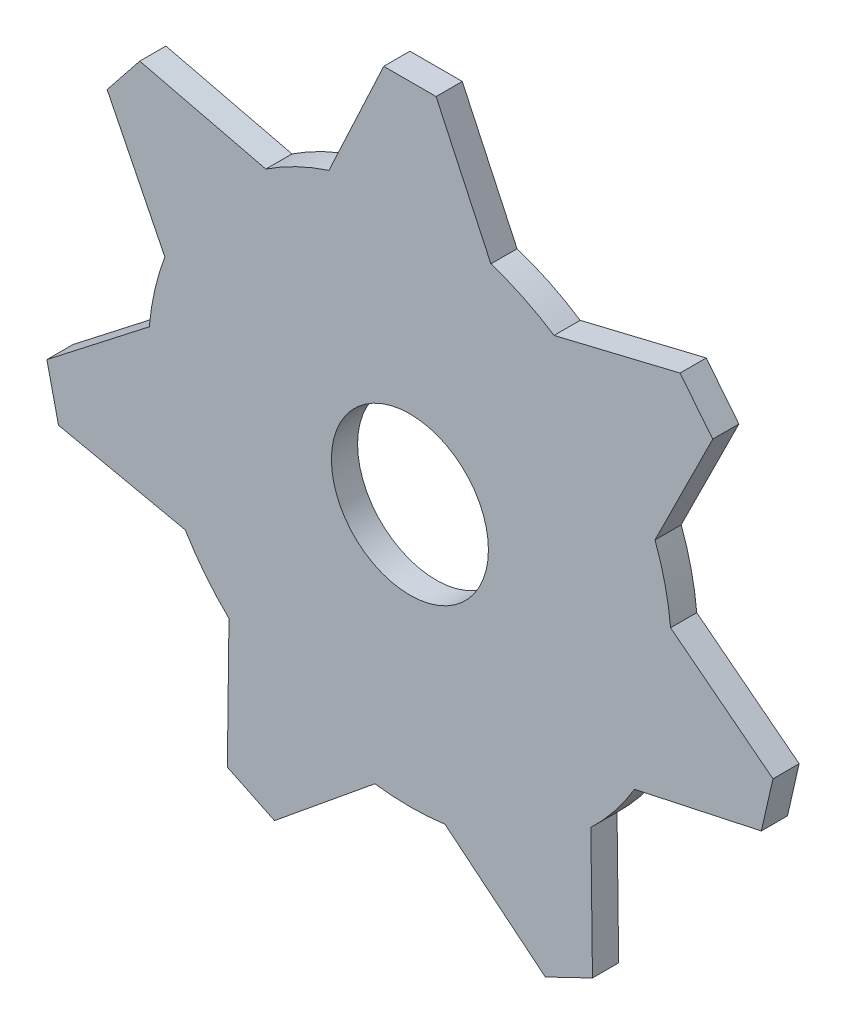
ISO-10303-21;
HEADER;
FILE_DESCRIPTION(('STEP AP214'),'2;1');
FILE_NAME('part.step','',(''),(''),'','','');
FILE_SCHEMA(('AUTOMOTIVE_DESIGN { 1 0 10303 214 1 1 1 1 }'));
ENDSEC;
DATA;
#1=APPLICATION_CONTEXT('core data for automotive mechanical design processes');
#2=APPLICATION_PROTOCOL_DEFINITION('international standard','automotive_design',2000,#1);
#3=PRODUCT_CONTEXT('',#1,'mechanical');
#4=PRODUCT('Part','Part','',(#3));
#5=PRODUCT_RELATED_PRODUCT_CATEGORY('part','',(#4));
#6=PRODUCT_DEFINITION_FORMATION('','',#4);
#7=PRODUCT_DEFINITION_CONTEXT('part definition',#1,'design');
#8=PRODUCT_DEFINITION('design','',#6,#7);
#9=PRODUCT_DEFINITION_SHAPE('','',#8);
#10=(LENGTH_UNIT() NAMED_UNIT(*) SI_UNIT(.MILLI.,.METRE.));
#11=(NAMED_UNIT(*) PLANE_ANGLE_UNIT() SI_UNIT($,.RADIAN.));
#12=(NAMED_UNIT(*) SI_UNIT($,.STERADIAN.) SOLID_ANGLE_UNIT());
#13=UNCERTAINTY_MEASURE_WITH_UNIT(LENGTH_MEASURE(1.E-05),#10,'distance_accuracy_value','');
#14=(GEOMETRIC_REPRESENTATION_CONTEXT(3) GLOBAL_UNCERTAINTY_ASSIGNED_CONTEXT((#13)) GLOBAL_UNIT_ASSIGNED_CONTEXT((#10,
#11,#12)) REPRESENTATION_CONTEXT('',''));
#15=CARTESIAN_POINT('',(0.,0.,0.));
#16=DIRECTION('',(0.,0.,1.));
#17=DIRECTION('',(1.,0.,0.));
#18=AXIS2_PLACEMENT_3D('',#15,#16,#17);
#19=CARTESIAN_POINT('',(0.,0.,1.27));
#20=DIRECTION('',(0.,0.,-1.));
#21=DIRECTION('',(-1.,0.,0.));
#22=AXIS2_PLACEMENT_3D('',#19,#20,#21);
#23=CYLINDRICAL_SURFACE('',#22,12.7);
#24=CARTESIAN_POINT('',(0.,0.,0.));
#25=DIRECTION('',(0.,0.,1.));
#26=DIRECTION('',(1.,0.,0.));
#27=AXIS2_PLACEMENT_3D('',#24,#25,#26);
#28=CIRCLE('',#27,12.7);
#29=CARTESIAN_POINT('',(6.99207173977358,10.6019306159708,0.));
#30=VERTEX_POINT('',#29);
#31=CARTESIAN_POINT('',(3.92943770689404,12.0768174329017,0.));
#32=VERTEX_POINT('',#31);
#33=EDGE_CURVE('E266',#30,#32,#28,.T.);
#34=ORIENTED_EDGE('',*,*,#33,.T.);
#35=DIRECTION('',(0.,0.,1.));
#36=VECTOR('',#35,1.);
#37=CARTESIAN_POINT('',(3.92943770689404,12.0768174329017,0.));
#38=LINE('',#37,#36);
#39=CARTESIAN_POINT('',(3.92943770689404,12.0768174329017,1.27));
#40=VERTEX_POINT('',#39);
#41=EDGE_CURVE('E256',#32,#40,#38,.T.);
#42=ORIENTED_EDGE('',*,*,#41,.T.);
#43=CARTESIAN_POINT('',(0.,0.,1.27));
#44=DIRECTION('',(0.,0.,1.));
#45=DIRECTION('',(1.,0.,0.));
#46=AXIS2_PLACEMENT_3D('',#43,#44,#45);
#47=CIRCLE('',#46,12.7);
#48=CARTESIAN_POINT('',(6.99207173977358,10.6019306159708,1.27));
#49=VERTEX_POINT('',#48);
#50=EDGE_CURVE('E263',#49,#40,#47,.T.);
#51=ORIENTED_EDGE('',*,*,#50,.F.);
#52=DIRECTION('',(0.,0.,1.));
#53=VECTOR('',#52,1.);
#54=CARTESIAN_POINT('',(6.99207173977358,10.6019306159708,0.));
#55=LINE('',#54,#53);
#56=EDGE_CURVE('E428',#30,#49,#55,.T.);
#57=ORIENTED_EDGE('',*,*,#56,.F.);
#58=EDGE_LOOP('',(#34,#42,#51,#57));
#59=FACE_BOUND('',#58,.T.);
#60=ADVANCED_FACE('F32',(#59),#23,.T.);
#61=CARTESIAN_POINT('',(11.8920004143489,4.45761440067741,0.));
#62=DIRECTION('',(0.895489924657309,-0.445081784436577,0.));
#63=DIRECTION('',(0.445081784436577,0.895489924657309,0.));
#64=AXIS2_PLACEMENT_3D('',#61,#62,#63);
#65=PLANE('',#64);
#66=DIRECTION('',(0.445081784436577,0.895489924657309,0.));
#67=VECTOR('',#66,1.);
#68=CARTESIAN_POINT('',(11.8920004143489,4.45761440067741,1.27));
#69=LINE('',#68,#67);
#70=CARTESIAN_POINT('',(11.8920004143489,4.45761440067741,1.27));
#71=VERTEX_POINT('',#70);
#72=CARTESIAN_POINT('',(14.692795806642,10.0927226943141,1.27));
#73=VERTEX_POINT('',#72);
#74=EDGE_CURVE('E431',#71,#73,#69,.T.);
#75=ORIENTED_EDGE('',*,*,#74,.F.);
#76=DIRECTION('',(0.,0.,1.));
#77=VECTOR('',#76,1.);
#78=CARTESIAN_POINT('',(11.8920004143489,4.45761440067741,0.));
#79=LINE('',#78,#77);
#80=CARTESIAN_POINT('',(11.8920004143489,4.45761440067741,0.));
#81=VERTEX_POINT('',#80);
#82=EDGE_CURVE('E40',#81,#71,#79,.T.);
#83=ORIENTED_EDGE('',*,*,#82,.F.);
#84=DIRECTION('',(0.445081784436577,0.895489924657309,0.));
#85=VECTOR('',#84,1.);
#86=CARTESIAN_POINT('',(11.8920004143489,4.45761440067741,0.));
#87=LINE('',#86,#85);
#88=CARTESIAN_POINT('',(14.692795806642,10.0927226943141,0.));
#89=VERTEX_POINT('',#88);
#90=EDGE_CURVE('E11',#81,#89,#87,.T.);
#91=ORIENTED_EDGE('',*,*,#90,.T.);
#92=DIRECTION('',(0.,0.,1.));
#93=VECTOR('',#92,1.);
#94=CARTESIAN_POINT('',(14.692795806642,10.0927226943141,0.));
#95=LINE('',#94,#93);
#96=EDGE_CURVE('E414',#89,#73,#95,.T.);
#97=ORIENTED_EDGE('',*,*,#96,.T.);
#98=EDGE_LOOP('',(#75,#83,#91,#97));
#99=FACE_BOUND('',#98,.T.);
#100=ADVANCED_FACE('F34',(#99),#65,.T.);
#101=CARTESIAN_POINT('',(13.1091317099208,12.0785746597828,0.));
#102=DIRECTION('',(-0.234657400467723,0.972078136985773,0.));
#103=DIRECTION('',(-0.972078136985773,-0.234657400467723,0.));
#104=AXIS2_PLACEMENT_3D('',#101,#102,#103);
#105=PLANE('',#104);
#106=DIRECTION('',(-0.972078136985773,-0.234657400467723,0.));
#107=VECTOR('',#106,1.);
#108=CARTESIAN_POINT('',(13.1091317099208,12.0785746597828,1.27));
#109=LINE('',#108,#107);
#110=CARTESIAN_POINT('',(13.1091317099208,12.0785746597828,1.27));
#111=VERTEX_POINT('',#110);
#112=EDGE_CURVE('E422',#111,#49,#109,.T.);
#113=ORIENTED_EDGE('',*,*,#112,.F.);
#114=DIRECTION('',(0.,0.,1.));
#115=VECTOR('',#114,1.);
#116=CARTESIAN_POINT('',(13.1091317099208,12.0785746597828,0.));
#117=LINE('',#116,#115);
#118=CARTESIAN_POINT('',(13.1091317099208,12.0785746597828,0.));
#119=VERTEX_POINT('',#118);
#120=EDGE_CURVE('E419',#119,#111,#117,.T.);
#121=ORIENTED_EDGE('',*,*,#120,.F.);
#122=DIRECTION('',(-0.972078136985773,-0.234657400467723,0.));
#123=VECTOR('',#122,1.);
#124=CARTESIAN_POINT('',(13.1091317099208,12.0785746597828,0.));
#125=LINE('',#124,#123);
#126=EDGE_CURVE('E425',#119,#30,#125,.T.);
#127=ORIENTED_EDGE('',*,*,#126,.T.);
#128=ORIENTED_EDGE('',*,*,#56,.T.);
#129=EDGE_LOOP('',(#113,#121,#127,#128));
#130=FACE_BOUND('',#129,.T.);
#131=ADVANCED_FACE('F443',(#130),#105,.T.);
#132=CARTESIAN_POINT('',(13.9009637582814,11.0856486770485,0.));
#133=DIRECTION('',(0.781831482468022,0.623489801858743,0.));
#134=DIRECTION('',(0.,0.,1.));
#135=AXIS2_PLACEMENT_3D('',#132,#133,#134);
#136=PLANE('',#135);
#137=DIRECTION('',(-0.623489801858743,0.781831482468022,0.));
#138=VECTOR('',#137,1.);
#139=CARTESIAN_POINT('',(13.9009637582814,11.0856486770485,1.27));
#140=LINE('',#139,#138);
#141=EDGE_CURVE('E412',#73,#111,#140,.T.);
#142=ORIENTED_EDGE('',*,*,#141,.F.);
#143=ORIENTED_EDGE('',*,*,#96,.F.);
#144=DIRECTION('',(-0.623489801858743,0.781831482468022,0.));
#145=VECTOR('',#144,1.);
#146=CARTESIAN_POINT('',(14.692795806642,10.0927226943141,0.));
#147=LINE('',#146,#145);
#148=EDGE_CURVE('E417',#89,#119,#147,.T.);
#149=ORIENTED_EDGE('',*,*,#148,.T.);
#150=ORIENTED_EDGE('',*,*,#120,.T.);
#151=EDGE_LOOP('',(#142,#143,#149,#150));
#152=FACE_BOUND('',#151,.T.);
#153=ADVANCED_FACE('F440',(#152),#136,.T.);
#154=CARTESIAN_POINT('',(12.6484085541212,1.14357380524166,0.));
#155=VERTEX_POINT('',#154);
#156=EDGE_CURVE('E47',#155,#81,#28,.T.);
#157=ORIENTED_EDGE('',*,*,#156,.T.);
#158=ORIENTED_EDGE('',*,*,#82,.T.);
#159=CARTESIAN_POINT('',(12.6484085541212,1.14357380524166,1.27));
#160=VERTEX_POINT('',#159);
#161=EDGE_CURVE('E55',#160,#71,#47,.T.);
#162=ORIENTED_EDGE('',*,*,#161,.F.);
#163=DIRECTION('',(0.,0.,1.));
#164=VECTOR('',#163,1.);
#165=CARTESIAN_POINT('',(12.6484085541212,1.14357380524166,0.));
#166=LINE('',#165,#164);
#167=EDGE_CURVE('E400',#155,#160,#166,.T.);
#168=ORIENTED_EDGE('',*,*,#167,.F.);
#169=EDGE_LOOP('',(#157,#158,#162,#168));
#170=FACE_BOUND('',#169,.T.);
#171=ADVANCED_FACE('F432',(#170),#23,.T.);
#172=CARTESIAN_POINT('',(10.8996442571988,-6.51826319401983,0.));
#173=DIRECTION('',(0.21034988434551,-0.977626168919302,0.));
#174=DIRECTION('',(0.977626168919302,0.21034988434551,0.));
#175=AXIS2_PLACEMENT_3D('',#172,#173,#174);
#176=PLANE('',#175);
#177=DIRECTION('',(0.977626168919302,0.21034988434551,0.));
#178=VECTOR('',#177,1.);
#179=CARTESIAN_POINT('',(10.8996442571988,-6.51826319401983,1.27));
#180=LINE('',#179,#178);
#181=CARTESIAN_POINT('',(10.8996442571988,-6.51826319401983,1.27));
#182=VERTEX_POINT('',#181);
#183=CARTESIAN_POINT('',(17.0516166924684,-5.19458065421402,1.27));
#184=VERTEX_POINT('',#183);
#185=EDGE_CURVE('E403',#182,#184,#180,.T.);
#186=ORIENTED_EDGE('',*,*,#185,.F.);
#187=DIRECTION('',(0.,0.,1.));
#188=VECTOR('',#187,1.);
#189=CARTESIAN_POINT('',(10.8996442571988,-6.51826319401983,0.));
#190=LINE('',#189,#188);
#191=CARTESIAN_POINT('',(10.8996442571988,-6.51826319401983,0.));
#192=VERTEX_POINT('',#191);
#193=EDGE_CURVE('E406',#192,#182,#190,.T.);
#194=ORIENTED_EDGE('',*,*,#193,.F.);
#195=DIRECTION('',(0.977626168919302,0.21034988434551,0.));
#196=VECTOR('',#195,1.);
#197=CARTESIAN_POINT('',(10.8996442571988,-6.51826319401983,0.));
#198=LINE('',#197,#196);
#199=CARTESIAN_POINT('',(17.0516166924684,-5.19458065421402,0.));
#200=VERTEX_POINT('',#199);
#201=EDGE_CURVE('E409',#192,#200,#198,.T.);
#202=ORIENTED_EDGE('',*,*,#201,.T.);
#203=DIRECTION('',(0.,0.,1.));
#204=VECTOR('',#203,1.);
#205=CARTESIAN_POINT('',(17.0516166924684,-5.19458065421402,0.));
#206=LINE('',#205,#204);
#207=EDGE_CURVE('E387',#200,#184,#206,.T.);
#208=ORIENTED_EDGE('',*,*,#207,.T.);
#209=EDGE_LOOP('',(#186,#194,#202,#208));
#210=FACE_BOUND('',#209,.T.);
#211=ADVANCED_FACE('F498',(#210),#176,.T.);
#212=CARTESIAN_POINT('',(17.6168198647174,-2.71826375727219,0.));
#213=DIRECTION('',(0.613694794792043,0.789543348300239,0.));
#214=DIRECTION('',(-0.789543348300239,0.613694794792043,0.));
#215=AXIS2_PLACEMENT_3D('',#212,#213,#214);
#216=PLANE('',#215);
#217=DIRECTION('',(-0.789543348300239,0.613694794792043,0.));
#218=VECTOR('',#217,1.);
#219=CARTESIAN_POINT('',(17.6168198647174,-2.71826375727219,1.27));
#220=LINE('',#219,#218);
#221=CARTESIAN_POINT('',(17.6168198647174,-2.71826375727219,1.27));
#222=VERTEX_POINT('',#221);
#223=EDGE_CURVE('E395',#222,#160,#220,.T.);
#224=ORIENTED_EDGE('',*,*,#223,.F.);
#225=DIRECTION('',(0.,0.,1.));
#226=VECTOR('',#225,1.);
#227=CARTESIAN_POINT('',(17.6168198647174,-2.71826375727219,0.));
#228=LINE('',#227,#226);
#229=CARTESIAN_POINT('',(17.6168198647174,-2.71826375727219,0.));
#230=VERTEX_POINT('',#229);
#231=EDGE_CURVE('E392',#230,#222,#228,.T.);
#232=ORIENTED_EDGE('',*,*,#231,.F.);
#233=DIRECTION('',(-0.789543348300239,0.613694794792043,0.));
#234=VECTOR('',#233,1.);
#235=CARTESIAN_POINT('',(17.6168198647174,-2.71826375727219,0.));
#236=LINE('',#235,#234);
#237=EDGE_CURVE('E397',#230,#155,#236,.T.);
#238=ORIENTED_EDGE('',*,*,#237,.T.);
#239=ORIENTED_EDGE('',*,*,#167,.T.);
#240=EDGE_LOOP('',(#224,#232,#238,#239));
#241=FACE_BOUND('',#240,.T.);
#242=ADVANCED_FACE('F504',(#241),#216,.T.);
#243=CARTESIAN_POINT('',(17.3342182785929,-3.9564222057431,0.));
#244=DIRECTION('',(0.974927912181826,-0.222520933956305,0.));
#245=DIRECTION('',(0.,0.,1.));
#246=AXIS2_PLACEMENT_3D('',#243,#244,#245);
#247=PLANE('',#246);
#248=DIRECTION('',(0.222520933956305,0.974927912181826,0.));
#249=VECTOR('',#248,1.);
#250=CARTESIAN_POINT('',(17.3342182785929,-3.9564222057431,1.27));
#251=LINE('',#250,#249);
#252=EDGE_CURVE('E385',#184,#222,#251,.T.);
#253=ORIENTED_EDGE('',*,*,#252,.F.);
#254=ORIENTED_EDGE('',*,*,#207,.F.);
#255=DIRECTION('',(0.222520933956305,0.974927912181826,0.));
#256=VECTOR('',#255,1.);
#257=CARTESIAN_POINT('',(17.0516166924684,-5.19458065421402,0.));
#258=LINE('',#257,#256);
#259=EDGE_CURVE('E390',#200,#230,#258,.T.);
#260=ORIENTED_EDGE('',*,*,#259,.T.);
#261=ORIENTED_EDGE('',*,*,#231,.T.);
#262=EDGE_LOOP('',(#253,#254,#260,#261));
#263=FACE_BOUND('',#262,.T.);
#264=ADVANCED_FACE('F510',(#263),#247,.T.);
#265=CARTESIAN_POINT('',(8.78023574670098,-9.1759174054889,0.));
#266=VERTEX_POINT('',#265);
#267=EDGE_CURVE('E355',#266,#192,#28,.T.);
#268=ORIENTED_EDGE('',*,*,#267,.T.);
#269=ORIENTED_EDGE('',*,*,#193,.T.);
#270=CARTESIAN_POINT('',(8.78023574670098,-9.1759174054889,1.27));
#271=VERTEX_POINT('',#270);
#272=EDGE_CURVE('E359',#271,#182,#47,.T.);
#273=ORIENTED_EDGE('',*,*,#272,.F.);
#274=DIRECTION('',(0.,0.,1.));
#275=VECTOR('',#274,1.);
#276=CARTESIAN_POINT('',(8.78023574670098,-9.1759174054889,0.));
#277=LINE('',#276,#275);
#278=EDGE_CURVE('E373',#266,#271,#277,.T.);
#279=ORIENTED_EDGE('',*,*,#278,.F.);
#280=EDGE_LOOP('',(#268,#269,#273,#279));
#281=FACE_BOUND('',#280,.T.);
#282=ADVANCED_FACE('F499',(#281),#23,.T.);
#283=CARTESIAN_POINT('',(1.69963366215422,-12.5857556552824,0.));
#284=DIRECTION('',(-0.63318790923413,-0.773998108266235,0.));
#285=DIRECTION('',(0.773998108266235,-0.63318790923413,0.));
#286=AXIS2_PLACEMENT_3D('',#283,#284,#285);
#287=PLANE('',#286);
#288=DIRECTION('',(0.773998108266235,-0.63318790923413,0.));
#289=VECTOR('',#288,1.);
#290=CARTESIAN_POINT('',(1.69963366215422,-12.5857556552824,1.27));
#291=LINE('',#290,#289);
#292=CARTESIAN_POINT('',(1.69963366215422,-12.5857556552824,1.27));
#293=VERTEX_POINT('',#292);
#294=CARTESIAN_POINT('',(6.57022241927424,-16.5702588199843,1.27));
#295=VERTEX_POINT('',#294);
#296=EDGE_CURVE('E376',#293,#295,#291,.T.);
#297=ORIENTED_EDGE('',*,*,#296,.F.);
#298=DIRECTION('',(0.,0.,1.));
#299=VECTOR('',#298,1.);
#300=CARTESIAN_POINT('',(1.69963366215422,-12.5857556552824,0.));
#301=LINE('',#300,#299);
#302=CARTESIAN_POINT('',(1.69963366215422,-12.5857556552824,0.));
#303=VERTEX_POINT('',#302);
#304=EDGE_CURVE('E379',#303,#293,#301,.T.);
#305=ORIENTED_EDGE('',*,*,#304,.F.);
#306=DIRECTION('',(0.773998108266235,-0.63318790923413,0.));
#307=VECTOR('',#306,1.);
#308=CARTESIAN_POINT('',(1.69963366215422,-12.5857556552824,0.));
#309=LINE('',#308,#307);
#310=CARTESIAN_POINT('',(6.57022241927424,-16.5702588199843,0.));
#311=VERTEX_POINT('',#310);
#312=EDGE_CURVE('E382',#303,#311,#309,.T.);
#313=ORIENTED_EDGE('',*,*,#312,.T.);
#314=DIRECTION('',(0.,0.,1.));
#315=VECTOR('',#314,1.);
#316=CARTESIAN_POINT('',(6.57022241927424,-16.5702588199843,0.));
#317=LINE('',#316,#315);
#318=EDGE_CURVE('E358',#311,#295,#317,.T.);
#319=ORIENTED_EDGE('',*,*,#318,.T.);
#320=EDGE_LOOP('',(#297,#305,#313,#319));
#321=FACE_BOUND('',#320,.T.);
#322=ADVANCED_FACE('F509',(#321),#287,.T.);
#323=CARTESIAN_POINT('',(8.85868334374638,-15.4681941226256,0.));
#324=DIRECTION('',(0.999922292480975,0.0124663145954185,0.));
#325=DIRECTION('',(-0.0124663145954185,0.999922292480975,0.));
#326=AXIS2_PLACEMENT_3D('',#323,#324,#325);
#327=PLANE('',#326);
#328=DIRECTION('',(-0.0124663145954185,0.999922292480975,0.));
#329=VECTOR('',#328,1.);
#330=CARTESIAN_POINT('',(8.85868334374638,-15.4681941226256,1.27));
#331=LINE('',#330,#329);
#332=CARTESIAN_POINT('',(8.85868334374638,-15.4681941226256,1.27));
#333=VERTEX_POINT('',#332);
#334=EDGE_CURVE('E367',#333,#271,#331,.T.);
#335=ORIENTED_EDGE('',*,*,#334,.F.);
#336=DIRECTION('',(0.,0.,1.));
#337=VECTOR('',#336,1.);
#338=CARTESIAN_POINT('',(8.85868334374638,-15.4681941226256,0.));
#339=LINE('',#338,#337);
#340=CARTESIAN_POINT('',(8.85868334374638,-15.4681941226256,0.));
#341=VERTEX_POINT('',#340);
#342=EDGE_CURVE('E364',#341,#333,#339,.T.);
#343=ORIENTED_EDGE('',*,*,#342,.F.);
#344=DIRECTION('',(-0.0124663145954185,0.999922292480975,0.));
#345=VECTOR('',#344,1.);
#346=CARTESIAN_POINT('',(8.85868334374638,-15.4681941226256,0.));
#347=LINE('',#346,#345);
#348=EDGE_CURVE('E370',#341,#266,#347,.T.);
#349=ORIENTED_EDGE('',*,*,#348,.T.);
#350=ORIENTED_EDGE('',*,*,#278,.T.);
#351=EDGE_LOOP('',(#335,#343,#349,#350));
#352=FACE_BOUND('',#351,.T.);
#353=ADVANCED_FACE('F515',(#352),#327,.T.);
#354=CARTESIAN_POINT('',(7.71445288151031,-16.019226471305,0.));
#355=DIRECTION('',(0.433883739117565,-0.900968867902416,0.));
#356=DIRECTION('',(0.,0.,1.));
#357=AXIS2_PLACEMENT_3D('',#354,#355,#356);
#358=PLANE('',#357);
#359=DIRECTION('',(0.900968867902416,0.433883739117565,0.));
#360=VECTOR('',#359,1.);
#361=CARTESIAN_POINT('',(7.71445288151031,-16.019226471305,1.27));
#362=LINE('',#361,#360);
#363=EDGE_CURVE('E356',#295,#333,#362,.T.);
#364=ORIENTED_EDGE('',*,*,#363,.F.);
#365=ORIENTED_EDGE('',*,*,#318,.F.);
#366=DIRECTION('',(0.900968867902416,0.433883739117565,0.));
#367=VECTOR('',#366,1.);
#368=CARTESIAN_POINT('',(6.57022241927424,-16.5702588199843,0.));
#369=LINE('',#368,#367);
#370=EDGE_CURVE('E362',#311,#341,#369,.T.);
#371=ORIENTED_EDGE('',*,*,#370,.T.);
#372=ORIENTED_EDGE('',*,*,#342,.T.);
#373=EDGE_LOOP('',(#364,#365,#371,#372));
#374=FACE_BOUND('',#373,.T.);
#375=ADVANCED_FACE('F522',(#374),#358,.T.);
#376=CARTESIAN_POINT('',(-1.69963366215404,-12.5857556552824,0.));
#377=VERTEX_POINT('',#376);
#378=EDGE_CURVE('E325',#377,#303,#28,.T.);
#379=ORIENTED_EDGE('',*,*,#378,.T.);
#380=ORIENTED_EDGE('',*,*,#304,.T.);
#381=CARTESIAN_POINT('',(-1.69963366215404,-12.5857556552824,1.27));
#382=VERTEX_POINT('',#381);
#383=EDGE_CURVE('E329',#382,#293,#47,.T.);
#384=ORIENTED_EDGE('',*,*,#383,.F.);
#385=DIRECTION('',(0.,0.,1.));
#386=VECTOR('',#385,1.);
#387=CARTESIAN_POINT('',(-1.69963366215404,-12.5857556552824,0.));
#388=LINE('',#387,#386);
#389=EDGE_CURVE('E343',#377,#382,#388,.T.);
#390=ORIENTED_EDGE('',*,*,#389,.F.);
#391=EDGE_LOOP('',(#379,#380,#384,#390));
#392=FACE_BOUND('',#391,.T.);
#393=ADVANCED_FACE('F492',(#392),#23,.T.);
#394=CARTESIAN_POINT('',(-8.78023574670086,-9.17591740548903,0.));
#395=DIRECTION('',(-0.999922292480975,0.0124663145954043,0.));
#396=DIRECTION('',(-0.0124663145954043,-0.999922292480975,0.));
#397=AXIS2_PLACEMENT_3D('',#394,#395,#396);
#398=PLANE('',#397);
#399=DIRECTION('',(-0.0124663145954043,-0.999922292480975,0.));
#400=VECTOR('',#399,1.);
#401=CARTESIAN_POINT('',(-8.78023574670086,-9.17591740548903,1.27));
#402=LINE('',#401,#400);
#403=CARTESIAN_POINT('',(-8.78023574670086,-9.17591740548903,1.27));
#404=VERTEX_POINT('',#403);
#405=CARTESIAN_POINT('',(-8.85868334374616,-15.4681941226258,1.27));
#406=VERTEX_POINT('',#405);
#407=EDGE_CURVE('E346',#404,#406,#402,.T.);
#408=ORIENTED_EDGE('',*,*,#407,.F.);
#409=DIRECTION('',(0.,0.,1.));
#410=VECTOR('',#409,1.);
#411=CARTESIAN_POINT('',(-8.78023574670086,-9.17591740548903,0.));
#412=LINE('',#411,#410);
#413=CARTESIAN_POINT('',(-8.78023574670086,-9.17591740548903,0.));
#414=VERTEX_POINT('',#413);
#415=EDGE_CURVE('E349',#414,#404,#412,.T.);
#416=ORIENTED_EDGE('',*,*,#415,.F.);
#417=DIRECTION('',(-0.0124663145954043,-0.999922292480975,0.));
#418=VECTOR('',#417,1.);
#419=CARTESIAN_POINT('',(-8.78023574670086,-9.17591740548903,0.));
#420=LINE('',#419,#418);
#421=CARTESIAN_POINT('',(-8.85868334374616,-15.4681941226258,0.));
#422=VERTEX_POINT('',#421);
#423=EDGE_CURVE('E352',#414,#422,#420,.T.);
#424=ORIENTED_EDGE('',*,*,#423,.T.);
#425=DIRECTION('',(0.,0.,1.));
#426=VECTOR('',#425,1.);
#427=CARTESIAN_POINT('',(-8.85868334374616,-15.4681941226258,0.));
#428=LINE('',#427,#426);
#429=EDGE_CURVE('E328',#422,#406,#428,.T.);
#430=ORIENTED_EDGE('',*,*,#429,.T.);
#431=EDGE_LOOP('',(#408,#416,#424,#430));
#432=FACE_BOUND('',#431,.T.);
#433=ADVANCED_FACE('F521',(#432),#398,.T.);
#434=CARTESIAN_POINT('',(-6.57022241927401,-16.5702588199844,0.));
#435=DIRECTION('',(0.633187909234141,-0.773998108266226,0.));
#436=DIRECTION('',(0.773998108266226,0.633187909234141,0.));
#437=AXIS2_PLACEMENT_3D('',#434,#435,#436);
#438=PLANE('',#437);
#439=DIRECTION('',(0.773998108266227,0.633187909234141,0.));
#440=VECTOR('',#439,1.);
#441=CARTESIAN_POINT('',(-6.57022241927401,-16.5702588199844,1.27));
#442=LINE('',#441,#440);
#443=CARTESIAN_POINT('',(-6.57022241927401,-16.5702588199844,1.27));
#444=VERTEX_POINT('',#443);
#445=EDGE_CURVE('E337',#444,#382,#442,.T.);
#446=ORIENTED_EDGE('',*,*,#445,.F.);
#447=DIRECTION('',(0.,0.,1.));
#448=VECTOR('',#447,1.);
#449=CARTESIAN_POINT('',(-6.57022241927401,-16.5702588199844,0.));
#450=LINE('',#449,#448);
#451=CARTESIAN_POINT('',(-6.57022241927401,-16.5702588199844,0.));
#452=VERTEX_POINT('',#451);
#453=EDGE_CURVE('E334',#452,#444,#450,.T.);
#454=ORIENTED_EDGE('',*,*,#453,.F.);
#455=DIRECTION('',(0.773998108266227,0.633187909234141,0.));
#456=VECTOR('',#455,1.);
#457=CARTESIAN_POINT('',(-6.57022241927401,-16.5702588199844,0.));
#458=LINE('',#457,#456);
#459=EDGE_CURVE('E340',#452,#377,#458,.T.);
#460=ORIENTED_EDGE('',*,*,#459,.T.);
#461=ORIENTED_EDGE('',*,*,#389,.T.);
#462=EDGE_LOOP('',(#446,#454,#460,#461));
#463=FACE_BOUND('',#462,.T.);
#464=ADVANCED_FACE('F527',(#463),#438,.T.);
#465=CARTESIAN_POINT('',(-7.71445288151009,-16.0192264713051,0.));
#466=DIRECTION('',(-0.433883739117553,-0.900968867902422,0.));
#467=DIRECTION('',(0.,0.,1.));
#468=AXIS2_PLACEMENT_3D('',#465,#466,#467);
#469=PLANE('',#468);
#470=DIRECTION('',(0.900968867902422,-0.433883739117553,0.));
#471=VECTOR('',#470,1.);
#472=CARTESIAN_POINT('',(-7.71445288151009,-16.0192264713051,1.27));
#473=LINE('',#472,#471);
#474=EDGE_CURVE('E326',#406,#444,#473,.T.);
#475=ORIENTED_EDGE('',*,*,#474,.F.);
#476=ORIENTED_EDGE('',*,*,#429,.F.);
#477=DIRECTION('',(0.900968867902422,-0.433883739117553,0.));
#478=VECTOR('',#477,1.);
#479=CARTESIAN_POINT('',(-8.85868334374616,-15.4681941226258,0.));
#480=LINE('',#479,#478);
#481=EDGE_CURVE('E332',#422,#452,#480,.T.);
#482=ORIENTED_EDGE('',*,*,#481,.T.);
#483=ORIENTED_EDGE('',*,*,#453,.T.);
#484=EDGE_LOOP('',(#475,#476,#482,#483));
#485=FACE_BOUND('',#484,.T.);
#486=ADVANCED_FACE('F491',(#485),#469,.T.);
#487=CARTESIAN_POINT('',(-10.8996442571987,-6.51826319401997,0.));
#488=VERTEX_POINT('',#487);
#489=EDGE_CURVE('E295',#488,#414,#28,.T.);
#490=ORIENTED_EDGE('',*,*,#489,.T.);
#491=ORIENTED_EDGE('',*,*,#415,.T.);
#492=CARTESIAN_POINT('',(-10.8996442571987,-6.51826319401997,1.27));
#493=VERTEX_POINT('',#492);
#494=EDGE_CURVE('E299',#493,#404,#47,.T.);
#495=ORIENTED_EDGE('',*,*,#494,.F.);
#496=DIRECTION('',(0.,0.,1.));
#497=VECTOR('',#496,1.);
#498=CARTESIAN_POINT('',(-10.8996442571987,-6.51826319401997,0.));
#499=LINE('',#498,#497);
#500=EDGE_CURVE('E313',#488,#493,#499,.T.);
#501=ORIENTED_EDGE('',*,*,#500,.F.);
#502=EDGE_LOOP('',(#490,#491,#495,#501));
#503=FACE_BOUND('',#502,.T.);
#504=ADVANCED_FACE('F474',(#503),#23,.T.);
#505=CARTESIAN_POINT('',(-12.6484085541212,1.14357380524149,0.));
#506=DIRECTION('',(-0.613694794792054,0.78954334830023,0.));
#507=DIRECTION('',(-0.78954334830023,-0.613694794792054,0.));
#508=AXIS2_PLACEMENT_3D('',#505,#506,#507);
#509=PLANE('',#508);
#510=DIRECTION('',(-0.78954334830023,-0.613694794792054,0.));
#511=VECTOR('',#510,1.);
#512=CARTESIAN_POINT('',(-12.6484085541212,1.14357380524149,1.27));
#513=LINE('',#512,#511);
#514=CARTESIAN_POINT('',(-12.6484085541212,1.14357380524149,1.27));
#515=VERTEX_POINT('',#514);
#516=CARTESIAN_POINT('',(-17.6168198647173,-2.71826375727242,1.27));
#517=VERTEX_POINT('',#516);
#518=EDGE_CURVE('E316',#515,#517,#513,.T.);
#519=ORIENTED_EDGE('',*,*,#518,.F.);
#520=DIRECTION('',(0.,0.,1.));
#521=VECTOR('',#520,1.);
#522=CARTESIAN_POINT('',(-12.6484085541212,1.14357380524149,0.));
#523=LINE('',#522,#521);
#524=CARTESIAN_POINT('',(-12.6484085541212,1.14357380524149,0.));
#525=VERTEX_POINT('',#524);
#526=EDGE_CURVE('E319',#525,#515,#523,.T.);
#527=ORIENTED_EDGE('',*,*,#526,.F.);
#528=DIRECTION('',(-0.78954334830023,-0.613694794792054,0.));
#529=VECTOR('',#528,1.);
#530=CARTESIAN_POINT('',(-12.6484085541212,1.14357380524149,0.));
#531=LINE('',#530,#529);
#532=CARTESIAN_POINT('',(-17.6168198647173,-2.71826375727242,0.));
#533=VERTEX_POINT('',#532);
#534=EDGE_CURVE('E322',#525,#533,#531,.T.);
#535=ORIENTED_EDGE('',*,*,#534,.T.);
#536=DIRECTION('',(0.,0.,1.));
#537=VECTOR('',#536,1.);
#538=CARTESIAN_POINT('',(-17.6168198647173,-2.71826375727242,0.));
#539=LINE('',#538,#537);
#540=EDGE_CURVE('E298',#533,#517,#539,.T.);
#541=ORIENTED_EDGE('',*,*,#540,.T.);
#542=EDGE_LOOP('',(#519,#527,#535,#541));
#543=FACE_BOUND('',#542,.T.);
#544=ADVANCED_FACE('F466',(#543),#509,.T.);
#545=CARTESIAN_POINT('',(-17.0516166924683,-5.19458065421425,0.));
#546=DIRECTION('',(-0.210349884345496,-0.977626168919304,0.));
#547=DIRECTION('',(0.977626168919304,-0.210349884345496,0.));
#548=AXIS2_PLACEMENT_3D('',#545,#546,#547);
#549=PLANE('',#548);
#550=DIRECTION('',(0.977626168919305,-0.210349884345496,0.));
#551=VECTOR('',#550,1.);
#552=CARTESIAN_POINT('',(-17.0516166924683,-5.19458065421425,1.27));
#553=LINE('',#552,#551);
#554=CARTESIAN_POINT('',(-17.0516166924683,-5.19458065421425,1.27));
#555=VERTEX_POINT('',#554);
#556=EDGE_CURVE('E307',#555,#493,#553,.T.);
#557=ORIENTED_EDGE('',*,*,#556,.F.);
#558=DIRECTION('',(0.,0.,1.));
#559=VECTOR('',#558,1.);
#560=CARTESIAN_POINT('',(-17.0516166924683,-5.19458065421425,0.));
#561=LINE('',#560,#559);
#562=CARTESIAN_POINT('',(-17.0516166924683,-5.19458065421425,0.));
#563=VERTEX_POINT('',#562);
#564=EDGE_CURVE('E304',#563,#555,#561,.T.);
#565=ORIENTED_EDGE('',*,*,#564,.F.);
#566=DIRECTION('',(0.977626168919305,-0.210349884345496,0.));
#567=VECTOR('',#566,1.);
#568=CARTESIAN_POINT('',(-17.0516166924683,-5.19458065421425,0.));
#569=LINE('',#568,#567);
#570=EDGE_CURVE('E310',#563,#488,#569,.T.);
#571=ORIENTED_EDGE('',*,*,#570,.T.);
#572=ORIENTED_EDGE('',*,*,#500,.T.);
#573=EDGE_LOOP('',(#557,#565,#571,#572));
#574=FACE_BOUND('',#573,.T.);
#575=ADVANCED_FACE('F482',(#574),#549,.T.);
#576=CARTESIAN_POINT('',(-17.3342182785928,-3.95642220574334,0.));
#577=DIRECTION('',(-0.974927912181823,-0.222520933956318,0.));
#578=DIRECTION('',(0.,0.,1.));
#579=AXIS2_PLACEMENT_3D('',#576,#577,#578);
#580=PLANE('',#579);
#581=DIRECTION('',(0.222520933956318,-0.974927912181823,0.));
#582=VECTOR('',#581,1.);
#583=CARTESIAN_POINT('',(-17.3342182785928,-3.95642220574334,1.27));
#584=LINE('',#583,#582);
#585=EDGE_CURVE('E296',#517,#555,#584,.T.);
#586=ORIENTED_EDGE('',*,*,#585,.F.);
#587=ORIENTED_EDGE('',*,*,#540,.F.);
#588=DIRECTION('',(0.222520933956318,-0.974927912181823,0.));
#589=VECTOR('',#588,1.);
#590=CARTESIAN_POINT('',(-17.6168198647173,-2.71826375727242,0.));
#591=LINE('',#590,#589);
#592=EDGE_CURVE('E302',#533,#563,#591,.T.);
#593=ORIENTED_EDGE('',*,*,#592,.T.);
#594=ORIENTED_EDGE('',*,*,#564,.T.);
#595=EDGE_LOOP('',(#586,#587,#593,#594));
#596=FACE_BOUND('',#595,.T.);
#597=ADVANCED_FACE('F471',(#596),#580,.T.);
#598=CARTESIAN_POINT('',(-11.8920004143489,4.45761440067724,0.));
#599=VERTEX_POINT('',#598);
#600=EDGE_CURVE('E262',#599,#525,#28,.T.);
#601=ORIENTED_EDGE('',*,*,#600,.T.);
#602=ORIENTED_EDGE('',*,*,#526,.T.);
#603=CARTESIAN_POINT('',(-11.8920004143489,4.45761440067724,1.27));
#604=VERTEX_POINT('',#603);
#605=EDGE_CURVE('E264',#604,#515,#47,.T.);
#606=ORIENTED_EDGE('',*,*,#605,.F.);
#607=DIRECTION('',(0.,0.,1.));
#608=VECTOR('',#607,1.);
#609=CARTESIAN_POINT('',(-11.8920004143489,4.45761440067724,0.));
#610=LINE('',#609,#608);
#611=EDGE_CURVE('E283',#599,#604,#610,.T.);
#612=ORIENTED_EDGE('',*,*,#611,.F.);
#613=EDGE_LOOP('',(#601,#602,#606,#612));
#614=FACE_BOUND('',#613,.T.);
#615=ADVANCED_FACE('F468',(#614),#23,.T.);
#616=CARTESIAN_POINT('',(-6.99207173977373,10.6019306159707,0.));
#617=DIRECTION('',(0.234657400467709,0.972078136985776,0.));
#618=DIRECTION('',(-0.972078136985776,0.234657400467709,0.));
#619=AXIS2_PLACEMENT_3D('',#616,#617,#618);
#620=PLANE('',#619);
#621=DIRECTION('',(-0.972078136985776,0.234657400467709,0.));
#622=VECTOR('',#621,1.);
#623=CARTESIAN_POINT('',(-6.99207173977373,10.6019306159707,1.27));
#624=LINE('',#623,#622);
#625=CARTESIAN_POINT('',(-6.99207173977373,10.6019306159707,1.27));
#626=VERTEX_POINT('',#625);
#627=CARTESIAN_POINT('',(-13.109131709921,12.0785746597827,1.27));
#628=VERTEX_POINT('',#627);
#629=EDGE_CURVE('E286',#626,#628,#624,.T.);
#630=ORIENTED_EDGE('',*,*,#629,.F.);
#631=DIRECTION('',(0.,0.,1.));
#632=VECTOR('',#631,1.);
#633=CARTESIAN_POINT('',(-6.99207173977373,10.6019306159707,0.));
#634=LINE('',#633,#632);
#635=CARTESIAN_POINT('',(-6.99207173977373,10.6019306159707,0.));
#636=VERTEX_POINT('',#635);
#637=EDGE_CURVE('E289',#636,#626,#634,.T.);
#638=ORIENTED_EDGE('',*,*,#637,.F.);
#639=DIRECTION('',(-0.972078136985776,0.234657400467709,0.));
#640=VECTOR('',#639,1.);
#641=CARTESIAN_POINT('',(-6.99207173977373,10.6019306159707,0.));
#642=LINE('',#641,#640);
#643=CARTESIAN_POINT('',(-13.109131709921,12.0785746597827,0.));
#644=VERTEX_POINT('',#643);
#645=EDGE_CURVE('E292',#636,#644,#642,.T.);
#646=ORIENTED_EDGE('',*,*,#645,.T.);
#647=DIRECTION('',(0.,0.,1.));
#648=VECTOR('',#647,1.);
#649=CARTESIAN_POINT('',(-13.109131709921,12.0785746597827,0.));
#650=LINE('',#649,#648);
#651=EDGE_CURVE('E269',#644,#628,#650,.T.);
#652=ORIENTED_EDGE('',*,*,#651,.T.);
#653=EDGE_LOOP('',(#630,#638,#646,#652));
#654=FACE_BOUND('',#653,.T.);
#655=ADVANCED_FACE('F470',(#654),#620,.T.);
#656=CARTESIAN_POINT('',(-14.6927958066422,10.0927226943139,0.));
#657=DIRECTION('',(-0.895489924657302,-0.44508178443659,0.));
#658=DIRECTION('',(0.44508178443659,-0.895489924657302,0.));
#659=AXIS2_PLACEMENT_3D('',#656,#657,#658);
#660=PLANE('',#659);
#661=DIRECTION('',(0.44508178443659,-0.895489924657302,0.));
#662=VECTOR('',#661,1.);
#663=CARTESIAN_POINT('',(-14.6927958066422,10.0927226943139,1.27));
#664=LINE('',#663,#662);
#665=CARTESIAN_POINT('',(-14.6927958066422,10.0927226943139,1.27));
#666=VERTEX_POINT('',#665);
#667=EDGE_CURVE('E277',#666,#604,#664,.T.);
#668=ORIENTED_EDGE('',*,*,#667,.F.);
#669=DIRECTION('',(0.,0.,1.));
#670=VECTOR('',#669,1.);
#671=CARTESIAN_POINT('',(-14.6927958066422,10.0927226943139,0.));
#672=LINE('',#671,#670);
#673=CARTESIAN_POINT('',(-14.6927958066422,10.0927226943139,0.));
#674=VERTEX_POINT('',#673);
#675=EDGE_CURVE('E274',#674,#666,#672,.T.);
#676=ORIENTED_EDGE('',*,*,#675,.F.);
#677=DIRECTION('',(0.44508178443659,-0.895489924657302,0.));
#678=VECTOR('',#677,1.);
#679=CARTESIAN_POINT('',(-14.6927958066422,10.0927226943139,0.));
#680=LINE('',#679,#678);
#681=EDGE_CURVE('E280',#674,#599,#680,.T.);
#682=ORIENTED_EDGE('',*,*,#681,.T.);
#683=ORIENTED_EDGE('',*,*,#611,.T.);
#684=EDGE_LOOP('',(#668,#676,#682,#683));
#685=FACE_BOUND('',#684,.T.);
#686=ADVANCED_FACE('F479',(#685),#660,.T.);
#687=CARTESIAN_POINT('',(-13.9009637582816,11.0856486770483,0.));
#688=DIRECTION('',(-0.781831482468031,0.623489801858732,0.));
#689=DIRECTION('',(0.,0.,1.));
#690=AXIS2_PLACEMENT_3D('',#687,#688,#689);
#691=PLANE('',#690);
#692=DIRECTION('',(-0.623489801858732,-0.781831482468031,0.));
#693=VECTOR('',#692,1.);
#694=CARTESIAN_POINT('',(-13.9009637582816,11.0856486770483,1.27));
#695=LINE('',#694,#693);
#696=EDGE_CURVE('E267',#628,#666,#695,.T.);
#697=ORIENTED_EDGE('',*,*,#696,.F.);
#698=ORIENTED_EDGE('',*,*,#651,.F.);
#699=DIRECTION('',(-0.623489801858732,-0.781831482468031,0.));
#700=VECTOR('',#699,1.);
#701=CARTESIAN_POINT('',(-13.109131709921,12.0785746597827,0.));
#702=LINE('',#701,#700);
#703=EDGE_CURVE('E272',#644,#674,#702,.T.);
#704=ORIENTED_EDGE('',*,*,#703,.T.);
#705=ORIENTED_EDGE('',*,*,#675,.T.);
#706=EDGE_LOOP('',(#697,#698,#704,#705));
#707=FACE_BOUND('',#706,.T.);
#708=ADVANCED_FACE('F488',(#707),#691,.T.);
#709=CARTESIAN_POINT('',(-3.92943770689404,12.0768174329017,0.));
#710=VERTEX_POINT('',#709);
#711=EDGE_CURVE('E244',#710,#636,#28,.T.);
#712=ORIENTED_EDGE('',*,*,#711,.T.);
#713=ORIENTED_EDGE('',*,*,#637,.T.);
#714=CARTESIAN_POINT('',(-3.92943770689404,12.0768174329017,1.27));
#715=VERTEX_POINT('',#714);
#716=EDGE_CURVE('E260',#715,#626,#47,.T.);
#717=ORIENTED_EDGE('',*,*,#716,.F.);
#718=DIRECTION('',(0.,0.,1.));
#719=VECTOR('',#718,1.);
#720=CARTESIAN_POINT('',(-3.92943770689404,12.0768174329017,0.));
#721=LINE('',#720,#719);
#722=EDGE_CURVE('E238',#710,#715,#721,.T.);
#723=ORIENTED_EDGE('',*,*,#722,.F.);
#724=EDGE_LOOP('',(#712,#713,#717,#723));
#725=FACE_BOUND('',#724,.T.);
#726=ADVANCED_FACE('F473',(#725),#23,.T.);
#727=CARTESIAN_POINT('',(0.,0.,1.27));
#728=DIRECTION('',(0.,0.,1.));
#729=DIRECTION('',(1.,0.,0.));
#730=AXIS2_PLACEMENT_3D('',#727,#728,#729);
#731=PLANE('',#730);
#732=CARTESIAN_POINT('',(0.,0.,1.27));
#733=DIRECTION('',(0.,0.,1.));
#734=DIRECTION('',(1.,0.,0.));
#735=AXIS2_PLACEMENT_3D('',#732,#733,#734);
#736=CIRCLE('',#735,3.81);
#737=CARTESIAN_POINT('',(3.81,0.,1.27));
#738=VERTEX_POINT('',#737);
#739=EDGE_CURVE('E251',#738,#738,#736,.F.);
#740=ORIENTED_EDGE('',*,*,#739,.T.);
#741=EDGE_LOOP('',(#740));
#742=FACE_BOUND('',#741,.T.);
#743=ORIENTED_EDGE('',*,*,#161,.T.);
#744=ORIENTED_EDGE('',*,*,#74,.T.);
#745=ORIENTED_EDGE('',*,*,#141,.T.);
#746=ORIENTED_EDGE('',*,*,#112,.T.);
#747=ORIENTED_EDGE('',*,*,#50,.T.);
#748=DIRECTION('',(-0.422618261740704,0.906307787036648,0.));
#749=VECTOR('',#748,1.);
#750=CARTESIAN_POINT('',(3.92943770689404,12.0768174329017,1.27));
#751=LINE('',#750,#749);
#752=CARTESIAN_POINT('',(1.27,17.78,1.27));
#753=VERTEX_POINT('',#752);
#754=EDGE_CURVE('E230',#40,#753,#751,.T.);
#755=ORIENTED_EDGE('',*,*,#754,.T.);
#756=DIRECTION('',(-1.,0.,0.));
#757=VECTOR('',#756,1.);
#758=CARTESIAN_POINT('',(0.,17.78,1.27));
#759=LINE('',#758,#757);
#760=CARTESIAN_POINT('',(-1.27,17.78,1.27));
#761=VERTEX_POINT('',#760);
#762=EDGE_CURVE('E249',#753,#761,#759,.T.);
#763=ORIENTED_EDGE('',*,*,#762,.T.);
#764=DIRECTION('',(-0.422618261740703,-0.906307787036648,0.));
#765=VECTOR('',#764,1.);
#766=CARTESIAN_POINT('',(-1.27,17.78,1.27));
#767=LINE('',#766,#765);
#768=EDGE_CURVE('E236',#761,#715,#767,.T.);
#769=ORIENTED_EDGE('',*,*,#768,.T.);
#770=ORIENTED_EDGE('',*,*,#716,.T.);
#771=ORIENTED_EDGE('',*,*,#629,.T.);
#772=ORIENTED_EDGE('',*,*,#696,.T.);
#773=ORIENTED_EDGE('',*,*,#667,.T.);
#774=ORIENTED_EDGE('',*,*,#605,.T.);
#775=ORIENTED_EDGE('',*,*,#518,.T.);
#776=ORIENTED_EDGE('',*,*,#585,.T.);
#777=ORIENTED_EDGE('',*,*,#556,.T.);
#778=ORIENTED_EDGE('',*,*,#494,.T.);
#779=ORIENTED_EDGE('',*,*,#407,.T.);
#780=ORIENTED_EDGE('',*,*,#474,.T.);
#781=ORIENTED_EDGE('',*,*,#445,.T.);
#782=ORIENTED_EDGE('',*,*,#383,.T.);
#783=ORIENTED_EDGE('',*,*,#296,.T.);
#784=ORIENTED_EDGE('',*,*,#363,.T.);
#785=ORIENTED_EDGE('',*,*,#334,.T.);
#786=ORIENTED_EDGE('',*,*,#272,.T.);
#787=ORIENTED_EDGE('',*,*,#185,.T.);
#788=ORIENTED_EDGE('',*,*,#252,.T.);
#789=ORIENTED_EDGE('',*,*,#223,.T.);
#790=EDGE_LOOP('',(#743,#744,#745,#746,#747,#755,#763,#769,#770,#771,#772,#773,#774,#775,#776,
#777,#778,#779,#780,#781,#782,#783,#784,#785,#786,#787,#788,#789));
#791=FACE_BOUND('',#790,.T.);
#792=ADVANCED_FACE('F445',(#742,#791),#731,.T.);
#793=CARTESIAN_POINT('',(0.,0.,0.));
#794=DIRECTION('',(0.,0.,1.));
#795=DIRECTION('',(1.,0.,0.));
#796=AXIS2_PLACEMENT_3D('',#793,#794,#795);
#797=PLANE('',#796);
#798=CARTESIAN_POINT('',(0.,0.,0.));
#799=DIRECTION('',(0.,0.,-1.));
#800=DIRECTION('',(-1.,0.,0.));
#801=AXIS2_PLACEMENT_3D('',#798,#799,#800);
#802=CIRCLE('',#801,3.81);
#803=CARTESIAN_POINT('',(-3.81,0.,0.));
#804=VERTEX_POINT('',#803);
#805=EDGE_CURVE('E762',#804,#804,#802,.T.);
#806=ORIENTED_EDGE('',*,*,#805,.F.);
#807=EDGE_LOOP('',(#806));
#808=FACE_BOUND('',#807,.T.);
#809=ORIENTED_EDGE('',*,*,#156,.F.);
#810=ORIENTED_EDGE('',*,*,#237,.F.);
#811=ORIENTED_EDGE('',*,*,#259,.F.);
#812=ORIENTED_EDGE('',*,*,#201,.F.);
#813=ORIENTED_EDGE('',*,*,#267,.F.);
#814=ORIENTED_EDGE('',*,*,#348,.F.);
#815=ORIENTED_EDGE('',*,*,#370,.F.);
#816=ORIENTED_EDGE('',*,*,#312,.F.);
#817=ORIENTED_EDGE('',*,*,#378,.F.);
#818=ORIENTED_EDGE('',*,*,#459,.F.);
#819=ORIENTED_EDGE('',*,*,#481,.F.);
#820=ORIENTED_EDGE('',*,*,#423,.F.);
#821=ORIENTED_EDGE('',*,*,#489,.F.);
#822=ORIENTED_EDGE('',*,*,#570,.F.);
#823=ORIENTED_EDGE('',*,*,#592,.F.);
#824=ORIENTED_EDGE('',*,*,#534,.F.);
#825=ORIENTED_EDGE('',*,*,#600,.F.);
#826=ORIENTED_EDGE('',*,*,#681,.F.);
#827=ORIENTED_EDGE('',*,*,#703,.F.);
#828=ORIENTED_EDGE('',*,*,#645,.F.);
#829=ORIENTED_EDGE('',*,*,#711,.F.);
#830=DIRECTION('',(-0.422618261740703,-0.906307787036648,0.));
#831=VECTOR('',#830,1.);
#832=CARTESIAN_POINT('',(-1.27,17.78,0.));
#833=LINE('',#832,#831);
#834=CARTESIAN_POINT('',(-1.27,17.78,0.));
#835=VERTEX_POINT('',#834);
#836=EDGE_CURVE('E229',#835,#710,#833,.T.);
#837=ORIENTED_EDGE('',*,*,#836,.F.);
#838=DIRECTION('',(-1.,0.,0.));
#839=VECTOR('',#838,1.);
#840=CARTESIAN_POINT('',(1.27,17.78,0.));
#841=LINE('',#840,#839);
#842=CARTESIAN_POINT('',(1.27,17.78,0.));
#843=VERTEX_POINT('',#842);
#844=EDGE_CURVE('E218',#843,#835,#841,.T.);
#845=ORIENTED_EDGE('',*,*,#844,.F.);
#846=DIRECTION('',(-0.422618261740704,0.906307787036648,0.));
#847=VECTOR('',#846,1.);
#848=CARTESIAN_POINT('',(3.92943770689404,12.0768174329017,0.));
#849=LINE('',#848,#847);
#850=EDGE_CURVE('E239',#32,#843,#849,.T.);
#851=ORIENTED_EDGE('',*,*,#850,.F.);
#852=ORIENTED_EDGE('',*,*,#33,.F.);
#853=ORIENTED_EDGE('',*,*,#126,.F.);
#854=ORIENTED_EDGE('',*,*,#148,.F.);
#855=ORIENTED_EDGE('',*,*,#90,.F.);
#856=EDGE_LOOP('',(#809,#810,#811,#812,#813,#814,#815,#816,#817,#818,#819,#820,#821,#822,#823,
#824,#825,#826,#827,#828,#829,#837,#845,#851,#852,#853,#854,#855));
#857=FACE_BOUND('',#856,.T.);
#858=ADVANCED_FACE('F242',(#808,#857),#797,.F.);
#859=CARTESIAN_POINT('',(3.92943770689404,12.0768174329017,0.));
#860=DIRECTION('',(0.906307787036648,0.422618261740704,0.));
#861=DIRECTION('',(-0.422618261740704,0.906307787036648,0.));
#862=AXIS2_PLACEMENT_3D('',#859,#860,#861);
#863=PLANE('',#862);
#864=ORIENTED_EDGE('',*,*,#754,.F.);
#865=ORIENTED_EDGE('',*,*,#41,.F.);
#866=ORIENTED_EDGE('',*,*,#850,.T.);
#867=DIRECTION('',(0.,0.,1.));
#868=VECTOR('',#867,1.);
#869=CARTESIAN_POINT('',(1.27,17.78,0.));
#870=LINE('',#869,#868);
#871=EDGE_CURVE('E224',#843,#753,#870,.T.);
#872=ORIENTED_EDGE('',*,*,#871,.T.);
#873=EDGE_LOOP('',(#864,#865,#866,#872));
#874=FACE_BOUND('',#873,.T.);
#875=ADVANCED_FACE('F450',(#874),#863,.T.);
#876=CARTESIAN_POINT('',(-1.27,17.78,0.));
#877=DIRECTION('',(-0.906307787036648,0.422618261740703,0.));
#878=DIRECTION('',(-0.422618261740703,-0.906307787036648,0.));
#879=AXIS2_PLACEMENT_3D('',#876,#877,#878);
#880=PLANE('',#879);
#881=ORIENTED_EDGE('',*,*,#768,.F.);
#882=DIRECTION('',(0.,0.,1.));
#883=VECTOR('',#882,1.);
#884=CARTESIAN_POINT('',(-1.27,17.78,0.));
#885=LINE('',#884,#883);
#886=EDGE_CURVE('E221',#835,#761,#885,.T.);
#887=ORIENTED_EDGE('',*,*,#886,.F.);
#888=ORIENTED_EDGE('',*,*,#836,.T.);
#889=ORIENTED_EDGE('',*,*,#722,.T.);
#890=EDGE_LOOP('',(#881,#887,#888,#889));
#891=FACE_BOUND('',#890,.T.);
#892=ADVANCED_FACE('F233',(#891),#880,.T.);
#893=CARTESIAN_POINT('',(0.,17.78,0.));
#894=DIRECTION('',(0.,1.,0.));
#895=DIRECTION('',(0.,0.,1.));
#896=AXIS2_PLACEMENT_3D('',#893,#894,#895);
#897=PLANE('',#896);
#898=ORIENTED_EDGE('',*,*,#762,.F.);
#899=ORIENTED_EDGE('',*,*,#871,.F.);
#900=ORIENTED_EDGE('',*,*,#844,.T.);
#901=ORIENTED_EDGE('',*,*,#886,.T.);
#902=EDGE_LOOP('',(#898,#899,#900,#901));
#903=FACE_BOUND('',#902,.T.);
#904=ADVANCED_FACE('F220',(#903),#897,.T.);
#905=CARTESIAN_POINT('',(0.,0.,12.046307345283));
#906=DIRECTION('',(0.,0.,-1.));
#907=DIRECTION('',(-1.,0.,0.));
#908=AXIS2_PLACEMENT_3D('',#905,#906,#907);
#909=CYLINDRICAL_SURFACE('',#908,3.81);
#910=ORIENTED_EDGE('',*,*,#805,.T.);
#911=EDGE_LOOP('',(#910));
#912=FACE_BOUND('',#911,.T.);
#913=ORIENTED_EDGE('',*,*,#739,.F.);
#914=EDGE_LOOP('',(#913));
#915=FACE_BOUND('',#914,.T.);
#916=ADVANCED_FACE('F716',(#912,#915),#909,.F.);
#917=CLOSED_SHELL('',(#60,#100,#131,#153,#171,#211,#242,#264,#282,#322,#353,#375,#393,#433,#464,
#486,#504,#544,#575,#597,#615,#655,#686,#708,#726,#792,#858,#875,#892,#904,#916));
#918=MANIFOLD_SOLID_BREP('B2',#917);
#919=ADVANCED_BREP_SHAPE_REPRESENTATION('',(#18,#918),#14);
#920=SHAPE_DEFINITION_REPRESENTATION(#9,#919);
ENDSEC;
END-ISO-10303-21;
